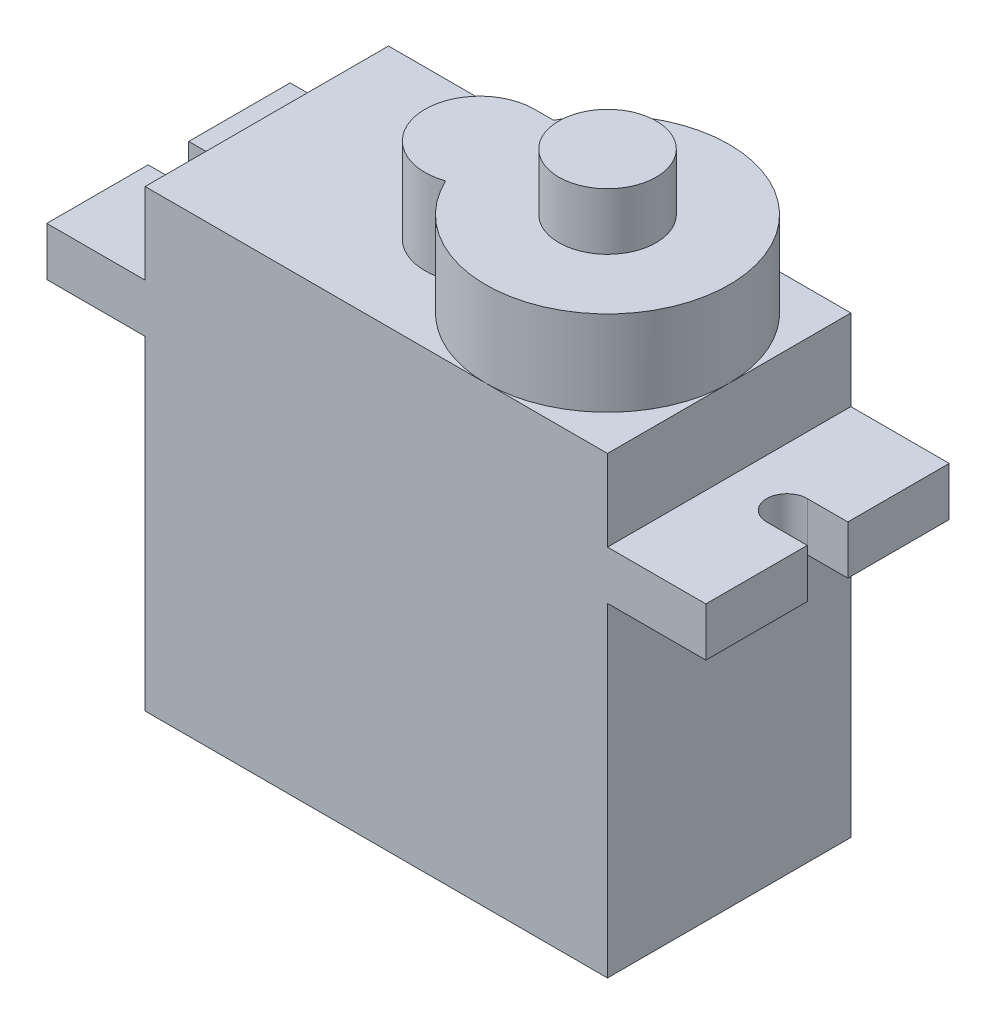
ISO-10303-21;
HEADER;
FILE_DESCRIPTION(('STEP AP214'),'2;1');
FILE_NAME('part.step','',(''),(''),'','','');
FILE_SCHEMA(('AUTOMOTIVE_DESIGN { 1 0 10303 214 1 1 1 1 }'));
ENDSEC;
DATA;
#1=APPLICATION_CONTEXT('core data for automotive mechanical design processes');
#2=APPLICATION_PROTOCOL_DEFINITION('international standard','automotive_design',2000,#1);
#3=PRODUCT_CONTEXT('',#1,'mechanical');
#4=PRODUCT('Part','Part','',(#3));
#5=PRODUCT_RELATED_PRODUCT_CATEGORY('part','',(#4));
#6=PRODUCT_DEFINITION_FORMATION('','',#4);
#7=PRODUCT_DEFINITION_CONTEXT('part definition',#1,'design');
#8=PRODUCT_DEFINITION('design','',#6,#7);
#9=PRODUCT_DEFINITION_SHAPE('','',#8);
#10=(LENGTH_UNIT() NAMED_UNIT(*) SI_UNIT(.MILLI.,.METRE.));
#11=(NAMED_UNIT(*) PLANE_ANGLE_UNIT() SI_UNIT($,.RADIAN.));
#12=(NAMED_UNIT(*) SI_UNIT($,.STERADIAN.) SOLID_ANGLE_UNIT());
#13=UNCERTAINTY_MEASURE_WITH_UNIT(LENGTH_MEASURE(1.E-05),#10,'distance_accuracy_value','');
#14=(GEOMETRIC_REPRESENTATION_CONTEXT(3) GLOBAL_UNCERTAINTY_ASSIGNED_CONTEXT((#13)) GLOBAL_UNIT_ASSIGNED_CONTEXT((#10,
#11,#12)) REPRESENTATION_CONTEXT('',''));
#15=CARTESIAN_POINT('',(0.,0.,0.));
#16=DIRECTION('',(0.,0.,1.));
#17=DIRECTION('',(1.,0.,0.));
#18=AXIS2_PLACEMENT_3D('',#15,#16,#17);
#19=CARTESIAN_POINT('',(0.,10.4,0.));
#20=DIRECTION('',(0.,1.,0.));
#21=DIRECTION('',(0.,0.,1.));
#22=AXIS2_PLACEMENT_3D('',#19,#20,#21);
#23=PLANE('',#22);
#24=CARTESIAN_POINT('',(-14.25,10.4,6.));
#25=DIRECTION('',(0.,1.,0.));
#26=DIRECTION('',(0.,0.,1.));
#27=AXIS2_PLACEMENT_3D('',#24,#25,#26);
#28=CIRCLE('',#27,1.);
#29=CARTESIAN_POINT('',(-14.25,10.4,7.));
#30=VERTEX_POINT('',#29);
#31=CARTESIAN_POINT('',(-14.25,10.4,5.));
#32=VERTEX_POINT('',#31);
#33=EDGE_CURVE('E286',#30,#32,#28,.T.);
#34=ORIENTED_EDGE('',*,*,#33,.F.);
#35=DIRECTION('',(-1.,0.,0.));
#36=VECTOR('',#35,1.);
#37=CARTESIAN_POINT('',(0.,10.4,7.));
#38=LINE('',#37,#36);
#39=CARTESIAN_POINT('',(-16.25,10.4,7.));
#40=VERTEX_POINT('',#39);
#41=EDGE_CURVE('E294',#30,#40,#38,.T.);
#42=ORIENTED_EDGE('',*,*,#41,.T.);
#43=DIRECTION('',(0.,0.,1.));
#44=VECTOR('',#43,1.);
#45=CARTESIAN_POINT('',(-16.25,10.4,0.));
#46=LINE('',#45,#44);
#47=CARTESIAN_POINT('',(-16.25,10.4,12.));
#48=VERTEX_POINT('',#47);
#49=EDGE_CURVE('E435',#40,#48,#46,.T.);
#50=ORIENTED_EDGE('',*,*,#49,.T.);
#51=DIRECTION('',(1.,0.,0.));
#52=VECTOR('',#51,1.);
#53=CARTESIAN_POINT('',(-16.25,10.4,12.));
#54=LINE('',#53,#52);
#55=CARTESIAN_POINT('',(-11.4,10.4,12.));
#56=VERTEX_POINT('',#55);
#57=EDGE_CURVE('E436',#48,#56,#54,.T.);
#58=ORIENTED_EDGE('',*,*,#57,.T.);
#59=DIRECTION('',(0.,0.,1.));
#60=VECTOR('',#59,1.);
#61=CARTESIAN_POINT('',(-11.4,10.4,0.));
#62=LINE('',#61,#60);
#63=CARTESIAN_POINT('',(-11.4,10.4,0.));
#64=VERTEX_POINT('',#63);
#65=EDGE_CURVE('E386',#64,#56,#62,.T.);
#66=ORIENTED_EDGE('',*,*,#65,.F.);
#67=DIRECTION('',(-1.,0.,0.));
#68=VECTOR('',#67,1.);
#69=CARTESIAN_POINT('',(-16.25,10.4,0.));
#70=LINE('',#69,#68);
#71=CARTESIAN_POINT('',(-16.25,10.4,0.));
#72=VERTEX_POINT('',#71);
#73=EDGE_CURVE('E444',#64,#72,#70,.T.);
#74=ORIENTED_EDGE('',*,*,#73,.T.);
#75=CARTESIAN_POINT('',(-16.25,10.4,5.));
#76=VERTEX_POINT('',#75);
#77=EDGE_CURVE('E430',#72,#76,#46,.T.);
#78=ORIENTED_EDGE('',*,*,#77,.T.);
#79=DIRECTION('',(-1.,0.,0.));
#80=VECTOR('',#79,1.);
#81=CARTESIAN_POINT('',(0.,10.4,5.));
#82=LINE('',#81,#80);
#83=EDGE_CURVE('E290',#32,#76,#82,.T.);
#84=ORIENTED_EDGE('',*,*,#83,.F.);
#85=EDGE_LOOP('',(#34,#42,#50,#58,#66,#74,#78,#84));
#86=FACE_BOUND('',#85,.T.);
#87=ADVANCED_FACE('F47',(#86),#23,.T.);
#88=CARTESIAN_POINT('',(-16.25,10.4,0.));
#89=DIRECTION('',(1.,0.,0.));
#90=DIRECTION('',(0.,0.,-1.));
#91=AXIS2_PLACEMENT_3D('',#88,#89,#90);
#92=PLANE('',#91);
#93=DIRECTION('',(0.,1.,0.));
#94=VECTOR('',#93,1.);
#95=CARTESIAN_POINT('',(-16.25,7.6,7.));
#96=LINE('',#95,#94);
#97=CARTESIAN_POINT('',(-16.25,8.,7.));
#98=VERTEX_POINT('',#97);
#99=EDGE_CURVE('E303',#98,#40,#96,.T.);
#100=ORIENTED_EDGE('',*,*,#99,.F.);
#101=DIRECTION('',(0.,0.,1.));
#102=VECTOR('',#101,1.);
#103=CARTESIAN_POINT('',(-16.25,8.,0.));
#104=LINE('',#103,#102);
#105=CARTESIAN_POINT('',(-16.25,8.,12.));
#106=VERTEX_POINT('',#105);
#107=EDGE_CURVE('E429',#98,#106,#104,.T.);
#108=ORIENTED_EDGE('',*,*,#107,.T.);
#109=DIRECTION('',(0.,-1.,0.));
#110=VECTOR('',#109,1.);
#111=CARTESIAN_POINT('',(-16.25,10.4,12.));
#112=LINE('',#111,#110);
#113=EDGE_CURVE('E479',#48,#106,#112,.T.);
#114=ORIENTED_EDGE('',*,*,#113,.F.);
#115=ORIENTED_EDGE('',*,*,#49,.F.);
#116=EDGE_LOOP('',(#100,#108,#114,#115));
#117=FACE_BOUND('',#116,.T.);
#118=ADVANCED_FACE('F610',(#117),#92,.F.);
#119=CARTESIAN_POINT('',(16.25,10.4,0.));
#120=DIRECTION('',(-1.,0.,0.));
#121=DIRECTION('',(0.,0.,1.));
#122=AXIS2_PLACEMENT_3D('',#119,#120,#121);
#123=PLANE('',#122);
#124=DIRECTION('',(0.,1.,0.));
#125=VECTOR('',#124,1.);
#126=CARTESIAN_POINT('',(16.25,7.6,5.));
#127=LINE('',#126,#125);
#128=CARTESIAN_POINT('',(16.25,8.,5.));
#129=VERTEX_POINT('',#128);
#130=CARTESIAN_POINT('',(16.25,10.4,5.));
#131=VERTEX_POINT('',#130);
#132=EDGE_CURVE('E291',#129,#131,#127,.T.);
#133=ORIENTED_EDGE('',*,*,#132,.F.);
#134=DIRECTION('',(0.,0.,-1.));
#135=VECTOR('',#134,1.);
#136=CARTESIAN_POINT('',(16.25,8.,0.));
#137=LINE('',#136,#135);
#138=CARTESIAN_POINT('',(16.25,8.,0.));
#139=VERTEX_POINT('',#138);
#140=EDGE_CURVE('E458',#129,#139,#137,.T.);
#141=ORIENTED_EDGE('',*,*,#140,.T.);
#142=DIRECTION('',(0.,-1.,0.));
#143=VECTOR('',#142,1.);
#144=CARTESIAN_POINT('',(16.25,10.4,0.));
#145=LINE('',#144,#143);
#146=CARTESIAN_POINT('',(16.25,10.4,0.));
#147=VERTEX_POINT('',#146);
#148=EDGE_CURVE('E471',#147,#139,#145,.T.);
#149=ORIENTED_EDGE('',*,*,#148,.F.);
#150=DIRECTION('',(0.,0.,-1.));
#151=VECTOR('',#150,1.);
#152=CARTESIAN_POINT('',(16.25,10.4,0.));
#153=LINE('',#152,#151);
#154=EDGE_CURVE('E439',#131,#147,#153,.T.);
#155=ORIENTED_EDGE('',*,*,#154,.F.);
#156=EDGE_LOOP('',(#133,#141,#149,#155));
#157=FACE_BOUND('',#156,.T.);
#158=ADVANCED_FACE('F647',(#157),#123,.F.);
#159=CARTESIAN_POINT('',(0.,8.,0.));
#160=DIRECTION('',(0.,1.,0.));
#161=DIRECTION('',(0.,0.,1.));
#162=AXIS2_PLACEMENT_3D('',#159,#160,#161);
#163=PLANE('',#162);
#164=DIRECTION('',(-1.,0.,0.));
#165=VECTOR('',#164,1.);
#166=CARTESIAN_POINT('',(0.,8.,7.));
#167=LINE('',#166,#165);
#168=CARTESIAN_POINT('',(-14.25,8.,7.));
#169=VERTEX_POINT('',#168);
#170=EDGE_CURVE('E11',#169,#98,#167,.T.);
#171=ORIENTED_EDGE('',*,*,#170,.F.);
#172=CARTESIAN_POINT('',(-14.25,8.,6.));
#173=DIRECTION('',(0.,1.,0.));
#174=DIRECTION('',(0.,0.,1.));
#175=AXIS2_PLACEMENT_3D('',#172,#173,#174);
#176=CIRCLE('',#175,1.);
#177=CARTESIAN_POINT('',(-14.25,8.,5.));
#178=VERTEX_POINT('',#177);
#179=EDGE_CURVE('E56',#169,#178,#176,.T.);
#180=ORIENTED_EDGE('',*,*,#179,.T.);
#181=DIRECTION('',(-1.,0.,0.));
#182=VECTOR('',#181,1.);
#183=CARTESIAN_POINT('',(0.,8.,5.));
#184=LINE('',#183,#182);
#185=CARTESIAN_POINT('',(-16.25,8.,5.));
#186=VERTEX_POINT('',#185);
#187=EDGE_CURVE('E516',#178,#186,#184,.T.);
#188=ORIENTED_EDGE('',*,*,#187,.T.);
#189=CARTESIAN_POINT('',(-16.25,8.,0.));
#190=VERTEX_POINT('',#189);
#191=EDGE_CURVE('E449',#190,#186,#104,.T.);
#192=ORIENTED_EDGE('',*,*,#191,.F.);
#193=DIRECTION('',(-1.,0.,0.));
#194=VECTOR('',#193,1.);
#195=CARTESIAN_POINT('',(-16.25,8.,0.));
#196=LINE('',#195,#194);
#197=CARTESIAN_POINT('',(-11.4,8.,0.));
#198=VERTEX_POINT('',#197);
#199=EDGE_CURVE('E463',#198,#190,#196,.T.);
#200=ORIENTED_EDGE('',*,*,#199,.F.);
#201=DIRECTION('',(0.,0.,-1.));
#202=VECTOR('',#201,1.);
#203=CARTESIAN_POINT('',(-11.4,8.,12.));
#204=LINE('',#203,#202);
#205=CARTESIAN_POINT('',(-11.4,8.,12.));
#206=VERTEX_POINT('',#205);
#207=EDGE_CURVE('E509',#206,#198,#204,.T.);
#208=ORIENTED_EDGE('',*,*,#207,.F.);
#209=DIRECTION('',(1.,0.,0.));
#210=VECTOR('',#209,1.);
#211=CARTESIAN_POINT('',(-16.25,8.,12.));
#212=LINE('',#211,#210);
#213=EDGE_CURVE('E454',#106,#206,#212,.T.);
#214=ORIENTED_EDGE('',*,*,#213,.F.);
#215=ORIENTED_EDGE('',*,*,#107,.F.);
#216=EDGE_LOOP('',(#171,#180,#188,#192,#200,#208,#214,#215));
#217=FACE_BOUND('',#216,.T.);
#218=ADVANCED_FACE('F523',(#217),#163,.F.);
#219=CARTESIAN_POINT('',(0.,14.4,0.));
#220=DIRECTION('',(0.,1.,0.));
#221=DIRECTION('',(0.,0.,1.));
#222=AXIS2_PLACEMENT_3D('',#219,#220,#221);
#223=PLANE('',#222);
#224=CARTESIAN_POINT('',(-0.9,14.4,6.));
#225=DIRECTION('',(0.,1.,0.));
#226=DIRECTION('',(0.,0.,1.));
#227=AXIS2_PLACEMENT_3D('',#224,#225,#226);
#228=CIRCLE('',#227,2.7);
#229=CARTESIAN_POINT('',(-0.899999999999998,14.4,3.3));
#230=VERTEX_POINT('',#229);
#231=CARTESIAN_POINT('',(-0.0285714285714308,14.4,8.55550625999977));
#232=VERTEX_POINT('',#231);
#233=EDGE_CURVE('E347',#230,#232,#228,.T.);
#234=ORIENTED_EDGE('',*,*,#233,.F.);
#235=DIRECTION('',(1.,0.,0.));
#236=VECTOR('',#235,1.);
#237=CARTESIAN_POINT('',(0.,14.4,3.3));
#238=LINE('',#237,#236);
#239=CARTESIAN_POINT('',(0.041828670152475,14.4,3.3));
#240=VERTEX_POINT('',#239);
#241=EDGE_CURVE('E356',#230,#240,#238,.T.);
#242=ORIENTED_EDGE('',*,*,#241,.T.);
#243=CARTESIAN_POINT('',(5.4,14.4,6.));
#244=DIRECTION('',(0.,1.,0.));
#245=DIRECTION('',(0.,0.,1.));
#246=AXIS2_PLACEMENT_3D('',#243,#244,#245);
#247=CIRCLE('',#246,6.);
#248=CARTESIAN_POINT('',(5.4,14.4,0.));
#249=VERTEX_POINT('',#248);
#250=EDGE_CURVE('E372',#249,#240,#247,.T.);
#251=ORIENTED_EDGE('',*,*,#250,.F.);
#252=DIRECTION('',(-1.,0.,0.));
#253=VECTOR('',#252,1.);
#254=CARTESIAN_POINT('',(-11.4,14.4,0.));
#255=LINE('',#254,#253);
#256=CARTESIAN_POINT('',(-11.4,14.4,0.));
#257=VERTEX_POINT('',#256);
#258=EDGE_CURVE('E402',#249,#257,#255,.T.);
#259=ORIENTED_EDGE('',*,*,#258,.T.);
#260=DIRECTION('',(0.,0.,1.));
#261=VECTOR('',#260,1.);
#262=CARTESIAN_POINT('',(-11.4,14.4,0.));
#263=LINE('',#262,#261);
#264=CARTESIAN_POINT('',(-11.4,14.4,12.));
#265=VERTEX_POINT('',#264);
#266=EDGE_CURVE('E387',#257,#265,#263,.T.);
#267=ORIENTED_EDGE('',*,*,#266,.T.);
#268=DIRECTION('',(1.,0.,0.));
#269=VECTOR('',#268,1.);
#270=CARTESIAN_POINT('',(-11.4,14.4,12.));
#271=LINE('',#270,#269);
#272=CARTESIAN_POINT('',(5.4,14.4,12.));
#273=VERTEX_POINT('',#272);
#274=EDGE_CURVE('E393',#265,#273,#271,.T.);
#275=ORIENTED_EDGE('',*,*,#274,.T.);
#276=EDGE_CURVE('E367',#232,#273,#247,.T.);
#277=ORIENTED_EDGE('',*,*,#276,.F.);
#278=EDGE_LOOP('',(#234,#242,#251,#259,#267,#275,#277));
#279=FACE_BOUND('',#278,.T.);
#280=ADVANCED_FACE('F595',(#279),#223,.T.);
#281=CARTESIAN_POINT('',(11.4,14.4,6.));
#282=VERTEX_POINT('',#281);
#283=EDGE_CURVE('E371',#273,#282,#247,.T.);
#284=ORIENTED_EDGE('',*,*,#283,.F.);
#285=CARTESIAN_POINT('',(11.4,14.4,12.));
#286=VERTEX_POINT('',#285);
#287=EDGE_CURVE('E391',#273,#286,#271,.T.);
#288=ORIENTED_EDGE('',*,*,#287,.T.);
#289=DIRECTION('',(0.,0.,-1.));
#290=VECTOR('',#289,1.);
#291=CARTESIAN_POINT('',(11.4,14.4,0.));
#292=LINE('',#291,#290);
#293=EDGE_CURVE('E398',#286,#282,#292,.T.);
#294=ORIENTED_EDGE('',*,*,#293,.T.);
#295=EDGE_LOOP('',(#284,#288,#294));
#296=FACE_BOUND('',#295,.T.);
#297=ADVANCED_FACE('F560',(#296),#223,.T.);
#298=CARTESIAN_POINT('',(11.4,8.,12.));
#299=DIRECTION('',(-1.,0.,0.));
#300=DIRECTION('',(0.,0.,1.));
#301=AXIS2_PLACEMENT_3D('',#298,#299,#300);
#302=PLANE('',#301);
#303=DIRECTION('',(0.,1.,0.));
#304=VECTOR('',#303,1.);
#305=CARTESIAN_POINT('',(11.4,8.,0.));
#306=LINE('',#305,#304);
#307=CARTESIAN_POINT('',(11.4,-8.,0.));
#308=VERTEX_POINT('',#307);
#309=CARTESIAN_POINT('',(11.4,8.,0.));
#310=VERTEX_POINT('',#309);
#311=EDGE_CURVE('E483',#308,#310,#306,.T.);
#312=ORIENTED_EDGE('',*,*,#311,.T.);
#313=DIRECTION('',(0.,0.,-1.));
#314=VECTOR('',#313,1.);
#315=CARTESIAN_POINT('',(11.4,8.,12.));
#316=LINE('',#315,#314);
#317=CARTESIAN_POINT('',(11.4,8.,12.));
#318=VERTEX_POINT('',#317);
#319=EDGE_CURVE('E512',#318,#310,#316,.T.);
#320=ORIENTED_EDGE('',*,*,#319,.F.);
#321=DIRECTION('',(0.,1.,0.));
#322=VECTOR('',#321,1.);
#323=CARTESIAN_POINT('',(11.4,8.,12.));
#324=LINE('',#323,#322);
#325=CARTESIAN_POINT('',(11.4,-8.,12.));
#326=VERTEX_POINT('',#325);
#327=EDGE_CURVE('E484',#326,#318,#324,.T.);
#328=ORIENTED_EDGE('',*,*,#327,.F.);
#329=DIRECTION('',(0.,0.,-1.));
#330=VECTOR('',#329,1.);
#331=CARTESIAN_POINT('',(11.4,-8.,12.));
#332=LINE('',#331,#330);
#333=EDGE_CURVE('E494',#326,#308,#332,.T.);
#334=ORIENTED_EDGE('',*,*,#333,.T.);
#335=EDGE_LOOP('',(#312,#320,#328,#334));
#336=FACE_BOUND('',#335,.T.);
#337=ADVANCED_FACE('F49',(#336),#302,.F.);
#338=CARTESIAN_POINT('',(-11.4,8.,12.));
#339=DIRECTION('',(1.,0.,0.));
#340=DIRECTION('',(0.,0.,-1.));
#341=AXIS2_PLACEMENT_3D('',#338,#339,#340);
#342=PLANE('',#341);
#343=DIRECTION('',(0.,-1.,0.));
#344=VECTOR('',#343,1.);
#345=CARTESIAN_POINT('',(-11.4,8.,0.));
#346=LINE('',#345,#344);
#347=CARTESIAN_POINT('',(-11.4,-8.,0.));
#348=VERTEX_POINT('',#347);
#349=EDGE_CURVE('E497',#198,#348,#346,.T.);
#350=ORIENTED_EDGE('',*,*,#349,.T.);
#351=DIRECTION('',(0.,0.,-1.));
#352=VECTOR('',#351,1.);
#353=CARTESIAN_POINT('',(-11.4,-8.,12.));
#354=LINE('',#353,#352);
#355=CARTESIAN_POINT('',(-11.4,-8.,12.));
#356=VERTEX_POINT('',#355);
#357=EDGE_CURVE('E505',#356,#348,#354,.T.);
#358=ORIENTED_EDGE('',*,*,#357,.F.);
#359=DIRECTION('',(0.,-1.,0.));
#360=VECTOR('',#359,1.);
#361=CARTESIAN_POINT('',(-11.4,8.,12.));
#362=LINE('',#361,#360);
#363=EDGE_CURVE('E487',#206,#356,#362,.T.);
#364=ORIENTED_EDGE('',*,*,#363,.F.);
#365=ORIENTED_EDGE('',*,*,#207,.T.);
#366=EDGE_LOOP('',(#350,#358,#364,#365));
#367=FACE_BOUND('',#366,.T.);
#368=ADVANCED_FACE('F615',(#367),#342,.F.);
#369=CARTESIAN_POINT('',(-11.4,-8.,12.));
#370=DIRECTION('',(0.,1.,0.));
#371=DIRECTION('',(0.,0.,1.));
#372=AXIS2_PLACEMENT_3D('',#369,#370,#371);
#373=PLANE('',#372);
#374=DIRECTION('',(1.,0.,0.));
#375=VECTOR('',#374,1.);
#376=CARTESIAN_POINT('',(-11.4,-8.,0.));
#377=LINE('',#376,#375);
#378=EDGE_CURVE('E488',#348,#308,#377,.T.);
#379=ORIENTED_EDGE('',*,*,#378,.T.);
#380=ORIENTED_EDGE('',*,*,#333,.F.);
#381=DIRECTION('',(1.,0.,0.));
#382=VECTOR('',#381,1.);
#383=CARTESIAN_POINT('',(-11.4,-8.,12.));
#384=LINE('',#383,#382);
#385=EDGE_CURVE('E491',#356,#326,#384,.T.);
#386=ORIENTED_EDGE('',*,*,#385,.F.);
#387=ORIENTED_EDGE('',*,*,#357,.T.);
#388=EDGE_LOOP('',(#379,#380,#386,#387));
#389=FACE_BOUND('',#388,.T.);
#390=ADVANCED_FACE('F618',(#389),#373,.F.);
#391=CARTESIAN_POINT('',(0.,0.,12.));
#392=DIRECTION('',(0.,0.,1.));
#393=DIRECTION('',(1.,0.,0.));
#394=AXIS2_PLACEMENT_3D('',#391,#392,#393);
#395=PLANE('',#394);
#396=ORIENTED_EDGE('',*,*,#327,.T.);
#397=CARTESIAN_POINT('',(16.25,8.,12.));
#398=VERTEX_POINT('',#397);
#399=EDGE_CURVE('E453',#318,#398,#212,.T.);
#400=ORIENTED_EDGE('',*,*,#399,.T.);
#401=DIRECTION('',(0.,-1.,0.));
#402=VECTOR('',#401,1.);
#403=CARTESIAN_POINT('',(16.25,10.4,12.));
#404=LINE('',#403,#402);
#405=CARTESIAN_POINT('',(16.25,10.4,12.));
#406=VERTEX_POINT('',#405);
#407=EDGE_CURVE('E475',#406,#398,#404,.T.);
#408=ORIENTED_EDGE('',*,*,#407,.F.);
#409=CARTESIAN_POINT('',(11.4,10.4,12.));
#410=VERTEX_POINT('',#409);
#411=EDGE_CURVE('E434',#410,#406,#54,.T.);
#412=ORIENTED_EDGE('',*,*,#411,.F.);
#413=DIRECTION('',(0.,-1.,0.));
#414=VECTOR('',#413,1.);
#415=CARTESIAN_POINT('',(11.4,14.4,12.));
#416=LINE('',#415,#414);
#417=EDGE_CURVE('E421',#286,#410,#416,.T.);
#418=ORIENTED_EDGE('',*,*,#417,.F.);
#419=ORIENTED_EDGE('',*,*,#287,.F.);
#420=ORIENTED_EDGE('',*,*,#274,.F.);
#421=DIRECTION('',(0.,-1.,0.));
#422=VECTOR('',#421,1.);
#423=CARTESIAN_POINT('',(-11.4,14.4,12.));
#424=LINE('',#423,#422);
#425=EDGE_CURVE('E425',#265,#56,#424,.T.);
#426=ORIENTED_EDGE('',*,*,#425,.T.);
#427=ORIENTED_EDGE('',*,*,#57,.F.);
#428=ORIENTED_EDGE('',*,*,#113,.T.);
#429=ORIENTED_EDGE('',*,*,#213,.T.);
#430=ORIENTED_EDGE('',*,*,#363,.T.);
#431=ORIENTED_EDGE('',*,*,#385,.T.);
#432=EDGE_LOOP('',(#396,#400,#408,#412,#418,#419,#420,#426,#427,#428,#429,#430,#431));
#433=FACE_BOUND('',#432,.T.);
#434=ADVANCED_FACE('F565',(#433),#395,.T.);
#435=CARTESIAN_POINT('',(0.,0.,0.));
#436=DIRECTION('',(0.,0.,1.));
#437=DIRECTION('',(1.,0.,0.));
#438=AXIS2_PLACEMENT_3D('',#435,#436,#437);
#439=PLANE('',#438);
#440=DIRECTION('',(1.,0.,0.));
#441=VECTOR('',#440,1.);
#442=CARTESIAN_POINT('',(5.,6.5,0.));
#443=LINE('',#442,#441);
#444=CARTESIAN_POINT('',(-5.,6.5,0.));
#445=VERTEX_POINT('',#444);
#446=CARTESIAN_POINT('',(5.,6.5,0.));
#447=VERTEX_POINT('',#446);
#448=EDGE_CURVE('E272',#445,#447,#443,.T.);
#449=ORIENTED_EDGE('',*,*,#448,.F.);
#450=DIRECTION('',(0.,1.,0.));
#451=VECTOR('',#450,1.);
#452=CARTESIAN_POINT('',(-5.,-6.5,0.));
#453=LINE('',#452,#451);
#454=CARTESIAN_POINT('',(-5.,-6.5,0.));
#455=VERTEX_POINT('',#454);
#456=EDGE_CURVE('E63',#455,#445,#453,.T.);
#457=ORIENTED_EDGE('',*,*,#456,.F.);
#458=DIRECTION('',(-1.,0.,0.));
#459=VECTOR('',#458,1.);
#460=CARTESIAN_POINT('',(5.,-6.5,0.));
#461=LINE('',#460,#459);
#462=CARTESIAN_POINT('',(5.,-6.5,0.));
#463=VERTEX_POINT('',#462);
#464=EDGE_CURVE('E259',#463,#455,#461,.T.);
#465=ORIENTED_EDGE('',*,*,#464,.F.);
#466=DIRECTION('',(0.,-1.,0.));
#467=VECTOR('',#466,1.);
#468=CARTESIAN_POINT('',(5.,-6.5,0.));
#469=LINE('',#468,#467);
#470=EDGE_CURVE('E263',#447,#463,#469,.T.);
#471=ORIENTED_EDGE('',*,*,#470,.F.);
#472=EDGE_LOOP('',(#449,#457,#465,#471));
#473=FACE_BOUND('',#472,.T.);
#474=ORIENTED_EDGE('',*,*,#311,.F.);
#475=ORIENTED_EDGE('',*,*,#378,.F.);
#476=ORIENTED_EDGE('',*,*,#349,.F.);
#477=ORIENTED_EDGE('',*,*,#199,.T.);
#478=DIRECTION('',(0.,-1.,0.));
#479=VECTOR('',#478,1.);
#480=CARTESIAN_POINT('',(-16.25,10.4,0.));
#481=LINE('',#480,#479);
#482=EDGE_CURVE('E448',#72,#190,#481,.T.);
#483=ORIENTED_EDGE('',*,*,#482,.F.);
#484=ORIENTED_EDGE('',*,*,#73,.F.);
#485=DIRECTION('',(0.,-1.,0.));
#486=VECTOR('',#485,1.);
#487=CARTESIAN_POINT('',(-11.4,14.4,0.));
#488=LINE('',#487,#486);
#489=EDGE_CURVE('E407',#257,#64,#488,.T.);
#490=ORIENTED_EDGE('',*,*,#489,.F.);
#491=ORIENTED_EDGE('',*,*,#258,.F.);
#492=CARTESIAN_POINT('',(11.4,14.4,0.));
#493=VERTEX_POINT('',#492);
#494=EDGE_CURVE('E403',#493,#249,#255,.T.);
#495=ORIENTED_EDGE('',*,*,#494,.F.);
#496=DIRECTION('',(0.,-1.,0.));
#497=VECTOR('',#496,1.);
#498=CARTESIAN_POINT('',(11.4,14.4,0.));
#499=LINE('',#498,#497);
#500=CARTESIAN_POINT('',(11.4,10.4,0.));
#501=VERTEX_POINT('',#500);
#502=EDGE_CURVE('E417',#493,#501,#499,.T.);
#503=ORIENTED_EDGE('',*,*,#502,.T.);
#504=EDGE_CURVE('E445',#147,#501,#70,.T.);
#505=ORIENTED_EDGE('',*,*,#504,.F.);
#506=ORIENTED_EDGE('',*,*,#148,.T.);
#507=EDGE_CURVE('E464',#139,#310,#196,.T.);
#508=ORIENTED_EDGE('',*,*,#507,.T.);
#509=EDGE_LOOP('',(#474,#475,#476,#477,#483,#484,#490,#491,#495,#503,#505,#506,#508));
#510=FACE_BOUND('',#509,.T.);
#511=ADVANCED_FACE('F605',(#473,#510),#439,.F.);
#512=DIRECTION('',(1.,0.,0.));
#513=VECTOR('',#512,1.);
#514=CARTESIAN_POINT('',(0.,8.,5.));
#515=LINE('',#514,#513);
#516=CARTESIAN_POINT('',(14.25,8.,5.));
#517=VERTEX_POINT('',#516);
#518=EDGE_CURVE('E339',#517,#129,#515,.T.);
#519=ORIENTED_EDGE('',*,*,#518,.F.);
#520=CARTESIAN_POINT('',(14.25,8.,6.));
#521=DIRECTION('',(0.,1.,0.));
#522=DIRECTION('',(0.,0.,1.));
#523=AXIS2_PLACEMENT_3D('',#520,#521,#522);
#524=CIRCLE('',#523,1.);
#525=CARTESIAN_POINT('',(14.25,8.,7.));
#526=VERTEX_POINT('',#525);
#527=EDGE_CURVE('E302',#526,#517,#524,.F.);
#528=ORIENTED_EDGE('',*,*,#527,.F.);
#529=DIRECTION('',(1.,0.,0.));
#530=VECTOR('',#529,1.);
#531=CARTESIAN_POINT('',(0.,8.,7.));
#532=LINE('',#531,#530);
#533=CARTESIAN_POINT('',(16.25,8.,7.));
#534=VERTEX_POINT('',#533);
#535=EDGE_CURVE('E335',#526,#534,#532,.T.);
#536=ORIENTED_EDGE('',*,*,#535,.T.);
#537=EDGE_CURVE('E459',#398,#534,#137,.T.);
#538=ORIENTED_EDGE('',*,*,#537,.F.);
#539=ORIENTED_EDGE('',*,*,#399,.F.);
#540=ORIENTED_EDGE('',*,*,#319,.T.);
#541=ORIENTED_EDGE('',*,*,#507,.F.);
#542=ORIENTED_EDGE('',*,*,#140,.F.);
#543=EDGE_LOOP('',(#519,#528,#536,#538,#539,#540,#541,#542));
#544=FACE_BOUND('',#543,.T.);
#545=ADVANCED_FACE('F629',(#544),#163,.F.);
#546=ORIENTED_EDGE('',*,*,#191,.T.);
#547=DIRECTION('',(0.,1.,0.));
#548=VECTOR('',#547,1.);
#549=CARTESIAN_POINT('',(-16.25,7.6,5.));
#550=LINE('',#549,#548);
#551=EDGE_CURVE('E306',#186,#76,#550,.T.);
#552=ORIENTED_EDGE('',*,*,#551,.T.);
#553=ORIENTED_EDGE('',*,*,#77,.F.);
#554=ORIENTED_EDGE('',*,*,#482,.T.);
#555=EDGE_LOOP('',(#546,#552,#553,#554));
#556=FACE_BOUND('',#555,.T.);
#557=ADVANCED_FACE('F542',(#556),#92,.F.);
#558=ORIENTED_EDGE('',*,*,#537,.T.);
#559=DIRECTION('',(0.,1.,0.));
#560=VECTOR('',#559,1.);
#561=CARTESIAN_POINT('',(16.25,7.6,7.));
#562=LINE('',#561,#560);
#563=CARTESIAN_POINT('',(16.25,10.4,7.));
#564=VERTEX_POINT('',#563);
#565=EDGE_CURVE('E324',#534,#564,#562,.T.);
#566=ORIENTED_EDGE('',*,*,#565,.T.);
#567=EDGE_CURVE('E440',#406,#564,#153,.T.);
#568=ORIENTED_EDGE('',*,*,#567,.F.);
#569=ORIENTED_EDGE('',*,*,#407,.T.);
#570=EDGE_LOOP('',(#558,#566,#568,#569));
#571=FACE_BOUND('',#570,.T.);
#572=ADVANCED_FACE('F627',(#571),#123,.F.);
#573=CARTESIAN_POINT('',(14.25,10.4,6.));
#574=DIRECTION('',(0.,1.,0.));
#575=DIRECTION('',(0.,0.,1.));
#576=AXIS2_PLACEMENT_3D('',#573,#574,#575);
#577=CIRCLE('',#576,1.);
#578=CARTESIAN_POINT('',(14.25,10.4,7.));
#579=VERTEX_POINT('',#578);
#580=CARTESIAN_POINT('',(14.25,10.4,5.));
#581=VERTEX_POINT('',#580);
#582=EDGE_CURVE('E314',#579,#581,#577,.F.);
#583=ORIENTED_EDGE('',*,*,#582,.T.);
#584=DIRECTION('',(1.,0.,0.));
#585=VECTOR('',#584,1.);
#586=CARTESIAN_POINT('',(0.,10.4,5.));
#587=LINE('',#586,#585);
#588=EDGE_CURVE('E71',#581,#131,#587,.T.);
#589=ORIENTED_EDGE('',*,*,#588,.T.);
#590=ORIENTED_EDGE('',*,*,#154,.T.);
#591=ORIENTED_EDGE('',*,*,#504,.T.);
#592=DIRECTION('',(0.,0.,-1.));
#593=VECTOR('',#592,1.);
#594=CARTESIAN_POINT('',(11.4,10.4,0.));
#595=LINE('',#594,#593);
#596=EDGE_CURVE('E392',#410,#501,#595,.T.);
#597=ORIENTED_EDGE('',*,*,#596,.F.);
#598=ORIENTED_EDGE('',*,*,#411,.T.);
#599=ORIENTED_EDGE('',*,*,#567,.T.);
#600=DIRECTION('',(1.,0.,0.));
#601=VECTOR('',#600,1.);
#602=CARTESIAN_POINT('',(0.,10.4,7.));
#603=LINE('',#602,#601);
#604=EDGE_CURVE('E318',#579,#564,#603,.T.);
#605=ORIENTED_EDGE('',*,*,#604,.F.);
#606=EDGE_LOOP('',(#583,#589,#590,#591,#597,#598,#599,#605));
#607=FACE_BOUND('',#606,.T.);
#608=ADVANCED_FACE('F639',(#607),#23,.T.);
#609=CARTESIAN_POINT('',(-11.4,14.4,0.));
#610=DIRECTION('',(1.,0.,0.));
#611=DIRECTION('',(0.,0.,-1.));
#612=AXIS2_PLACEMENT_3D('',#609,#610,#611);
#613=PLANE('',#612);
#614=ORIENTED_EDGE('',*,*,#65,.T.);
#615=ORIENTED_EDGE('',*,*,#425,.F.);
#616=ORIENTED_EDGE('',*,*,#266,.F.);
#617=ORIENTED_EDGE('',*,*,#489,.T.);
#618=EDGE_LOOP('',(#614,#615,#616,#617));
#619=FACE_BOUND('',#618,.T.);
#620=ADVANCED_FACE('F601',(#619),#613,.F.);
#621=CARTESIAN_POINT('',(11.4,14.4,0.));
#622=DIRECTION('',(-1.,0.,0.));
#623=DIRECTION('',(0.,0.,1.));
#624=AXIS2_PLACEMENT_3D('',#621,#622,#623);
#625=PLANE('',#624);
#626=ORIENTED_EDGE('',*,*,#596,.T.);
#627=ORIENTED_EDGE('',*,*,#502,.F.);
#628=EDGE_CURVE('E397',#282,#493,#292,.T.);
#629=ORIENTED_EDGE('',*,*,#628,.F.);
#630=ORIENTED_EDGE('',*,*,#293,.F.);
#631=ORIENTED_EDGE('',*,*,#417,.T.);
#632=EDGE_LOOP('',(#626,#627,#629,#630,#631));
#633=FACE_BOUND('',#632,.T.);
#634=ADVANCED_FACE('F569',(#633),#625,.F.);
#635=EDGE_CURVE('E575',#282,#249,#247,.T.);
#636=ORIENTED_EDGE('',*,*,#635,.F.);
#637=ORIENTED_EDGE('',*,*,#628,.T.);
#638=ORIENTED_EDGE('',*,*,#494,.T.);
#639=EDGE_LOOP('',(#636,#637,#638));
#640=FACE_BOUND('',#639,.T.);
#641=ADVANCED_FACE('F573',(#640),#223,.T.);
#642=CARTESIAN_POINT('',(-0.9,18.6,6.));
#643=DIRECTION('',(0.,-1.,0.));
#644=DIRECTION('',(0.,0.,-1.));
#645=AXIS2_PLACEMENT_3D('',#642,#643,#644);
#646=CYLINDRICAL_SURFACE('',#645,2.7);
#647=ORIENTED_EDGE('',*,*,#233,.T.);
#648=DIRECTION('',(0.,-1.,0.));
#649=VECTOR('',#648,1.);
#650=CARTESIAN_POINT('',(-0.0285714285714308,18.6,8.55550625999977));
#651=LINE('',#650,#649);
#652=CARTESIAN_POINT('',(-0.0285714285714308,18.6,8.55550625999977));
#653=VERTEX_POINT('',#652);
#654=EDGE_CURVE('E382',#653,#232,#651,.T.);
#655=ORIENTED_EDGE('',*,*,#654,.F.);
#656=CARTESIAN_POINT('',(-0.9,18.6,6.));
#657=DIRECTION('',(0.,1.,0.));
#658=DIRECTION('',(0.,0.,1.));
#659=AXIS2_PLACEMENT_3D('',#656,#657,#658);
#660=CIRCLE('',#659,2.7);
#661=CARTESIAN_POINT('',(-0.899999999999998,18.6,3.3));
#662=VERTEX_POINT('',#661);
#663=EDGE_CURVE('E351',#662,#653,#660,.T.);
#664=ORIENTED_EDGE('',*,*,#663,.F.);
#665=DIRECTION('',(0.,-1.,0.));
#666=VECTOR('',#665,1.);
#667=CARTESIAN_POINT('',(-0.899999999999998,18.6,3.3));
#668=LINE('',#667,#666);
#669=EDGE_CURVE('E363',#662,#230,#668,.T.);
#670=ORIENTED_EDGE('',*,*,#669,.T.);
#671=EDGE_LOOP('',(#647,#655,#664,#670));
#672=FACE_BOUND('',#671,.T.);
#673=ADVANCED_FACE('F594',(#672),#646,.T.);
#674=CARTESIAN_POINT('',(5.4,18.6,6.));
#675=DIRECTION('',(0.,-1.,0.));
#676=DIRECTION('',(0.,0.,-1.));
#677=AXIS2_PLACEMENT_3D('',#674,#675,#676);
#678=CYLINDRICAL_SURFACE('',#677,6.);
#679=ORIENTED_EDGE('',*,*,#276,.T.);
#680=ORIENTED_EDGE('',*,*,#283,.T.);
#681=ORIENTED_EDGE('',*,*,#635,.T.);
#682=ORIENTED_EDGE('',*,*,#250,.T.);
#683=DIRECTION('',(0.,-1.,0.));
#684=VECTOR('',#683,1.);
#685=CARTESIAN_POINT('',(0.041828670152475,18.6,3.3));
#686=LINE('',#685,#684);
#687=CARTESIAN_POINT('',(0.041828670152475,18.6,3.3));
#688=VERTEX_POINT('',#687);
#689=EDGE_CURVE('E378',#688,#240,#686,.T.);
#690=ORIENTED_EDGE('',*,*,#689,.F.);
#691=CARTESIAN_POINT('',(5.4,18.6,6.));
#692=DIRECTION('',(0.,1.,0.));
#693=DIRECTION('',(0.,0.,1.));
#694=AXIS2_PLACEMENT_3D('',#691,#692,#693);
#695=CIRCLE('',#694,6.);
#696=EDGE_CURVE('E355',#653,#688,#695,.T.);
#697=ORIENTED_EDGE('',*,*,#696,.F.);
#698=ORIENTED_EDGE('',*,*,#654,.T.);
#699=EDGE_LOOP('',(#679,#680,#681,#682,#690,#697,#698));
#700=FACE_BOUND('',#699,.T.);
#701=ADVANCED_FACE('F582',(#700),#678,.T.);
#702=CARTESIAN_POINT('',(0.,18.6,3.3));
#703=DIRECTION('',(0.,0.,-1.));
#704=DIRECTION('',(-1.,0.,0.));
#705=AXIS2_PLACEMENT_3D('',#702,#703,#704);
#706=PLANE('',#705);
#707=ORIENTED_EDGE('',*,*,#241,.F.);
#708=ORIENTED_EDGE('',*,*,#669,.F.);
#709=DIRECTION('',(1.,0.,0.));
#710=VECTOR('',#709,1.);
#711=CARTESIAN_POINT('',(0.,18.6,3.3));
#712=LINE('',#711,#710);
#713=EDGE_CURVE('E359',#662,#688,#712,.T.);
#714=ORIENTED_EDGE('',*,*,#713,.T.);
#715=ORIENTED_EDGE('',*,*,#689,.T.);
#716=EDGE_LOOP('',(#707,#708,#714,#715));
#717=FACE_BOUND('',#716,.T.);
#718=ADVANCED_FACE('F587',(#717),#706,.T.);
#719=CARTESIAN_POINT('',(0.,18.6,0.));
#720=DIRECTION('',(0.,1.,0.));
#721=DIRECTION('',(0.,0.,1.));
#722=AXIS2_PLACEMENT_3D('',#719,#720,#721);
#723=PLANE('',#722);
#724=CARTESIAN_POINT('',(5.4,18.6,6.));
#725=DIRECTION('',(0.,1.,0.));
#726=DIRECTION('',(0.,0.,1.));
#727=AXIS2_PLACEMENT_3D('',#724,#725,#726);
#728=CIRCLE('',#727,2.4);
#729=CARTESIAN_POINT('',(5.4,18.6,8.4));
#730=VERTEX_POINT('',#729);
#731=EDGE_CURVE('E342',#730,#730,#728,.T.);
#732=ORIENTED_EDGE('',*,*,#731,.F.);
#733=EDGE_LOOP('',(#732));
#734=FACE_BOUND('',#733,.T.);
#735=ORIENTED_EDGE('',*,*,#663,.T.);
#736=ORIENTED_EDGE('',*,*,#696,.T.);
#737=ORIENTED_EDGE('',*,*,#713,.F.);
#738=EDGE_LOOP('',(#735,#736,#737));
#739=FACE_BOUND('',#738,.T.);
#740=ADVANCED_FACE('F591',(#734,#739),#723,.T.);
#741=CARTESIAN_POINT('',(5.4,21.4,6.));
#742=DIRECTION('',(0.,-1.,0.));
#743=DIRECTION('',(0.,0.,-1.));
#744=AXIS2_PLACEMENT_3D('',#741,#742,#743);
#745=CYLINDRICAL_SURFACE('',#744,2.4);
#746=CARTESIAN_POINT('',(5.4,21.4,6.));
#747=DIRECTION('',(0.,1.,0.));
#748=DIRECTION('',(0.,0.,1.));
#749=AXIS2_PLACEMENT_3D('',#746,#747,#748);
#750=CIRCLE('',#749,2.4);
#751=CARTESIAN_POINT('',(5.4,21.4,8.4));
#752=VERTEX_POINT('',#751);
#753=EDGE_CURVE('E343',#752,#752,#750,.T.);
#754=ORIENTED_EDGE('',*,*,#753,.F.);
#755=EDGE_LOOP('',(#754));
#756=FACE_BOUND('',#755,.T.);
#757=ORIENTED_EDGE('',*,*,#731,.T.);
#758=EDGE_LOOP('',(#757));
#759=FACE_BOUND('',#758,.T.);
#760=ADVANCED_FACE('F781',(#756,#759),#745,.T.);
#761=CARTESIAN_POINT('',(5.4,21.4,6.));
#762=DIRECTION('',(0.,1.,0.));
#763=DIRECTION('',(0.,0.,1.));
#764=AXIS2_PLACEMENT_3D('',#761,#762,#763);
#765=PLANE('',#764);
#766=ORIENTED_EDGE('',*,*,#753,.T.);
#767=EDGE_LOOP('',(#766));
#768=FACE_BOUND('',#767,.T.);
#769=ADVANCED_FACE('F797',(#768),#765,.T.);
#770=CARTESIAN_POINT('',(-14.25,7.6,6.));
#771=DIRECTION('',(0.,1.,0.));
#772=DIRECTION('',(0.,0.,1.));
#773=AXIS2_PLACEMENT_3D('',#770,#771,#772);
#774=CYLINDRICAL_SURFACE('',#773,1.);
#775=DIRECTION('',(0.,1.,0.));
#776=VECTOR('',#775,1.);
#777=CARTESIAN_POINT('',(-14.25,7.6,7.));
#778=LINE('',#777,#776);
#779=EDGE_CURVE('E299',#169,#30,#778,.T.);
#780=ORIENTED_EDGE('',*,*,#779,.T.);
#781=ORIENTED_EDGE('',*,*,#33,.T.);
#782=DIRECTION('',(0.,1.,0.));
#783=VECTOR('',#782,1.);
#784=CARTESIAN_POINT('',(-14.25,7.6,5.));
#785=LINE('',#784,#783);
#786=EDGE_CURVE('E298',#178,#32,#785,.T.);
#787=ORIENTED_EDGE('',*,*,#786,.F.);
#788=ORIENTED_EDGE('',*,*,#179,.F.);
#789=EDGE_LOOP('',(#780,#781,#787,#788));
#790=FACE_BOUND('',#789,.T.);
#791=ADVANCED_FACE('F529',(#790),#774,.F.);
#792=CARTESIAN_POINT('',(0.,7.6,7.));
#793=DIRECTION('',(0.,0.,-1.));
#794=DIRECTION('',(-1.,0.,0.));
#795=AXIS2_PLACEMENT_3D('',#792,#793,#794);
#796=PLANE('',#795);
#797=ORIENTED_EDGE('',*,*,#170,.T.);
#798=ORIENTED_EDGE('',*,*,#99,.T.);
#799=ORIENTED_EDGE('',*,*,#41,.F.);
#800=ORIENTED_EDGE('',*,*,#779,.F.);
#801=EDGE_LOOP('',(#797,#798,#799,#800));
#802=FACE_BOUND('',#801,.T.);
#803=ADVANCED_FACE('F532',(#802),#796,.T.);
#804=CARTESIAN_POINT('',(0.,7.6,5.));
#805=DIRECTION('',(0.,0.,-1.));
#806=DIRECTION('',(-1.,0.,0.));
#807=AXIS2_PLACEMENT_3D('',#804,#805,#806);
#808=PLANE('',#807);
#809=ORIENTED_EDGE('',*,*,#786,.T.);
#810=ORIENTED_EDGE('',*,*,#83,.T.);
#811=ORIENTED_EDGE('',*,*,#551,.F.);
#812=ORIENTED_EDGE('',*,*,#187,.F.);
#813=EDGE_LOOP('',(#809,#810,#811,#812));
#814=FACE_BOUND('',#813,.T.);
#815=ADVANCED_FACE('F540',(#814),#808,.F.);
#816=CARTESIAN_POINT('',(0.,7.6,5.));
#817=DIRECTION('',(0.,0.,1.));
#818=DIRECTION('',(1.,0.,0.));
#819=AXIS2_PLACEMENT_3D('',#816,#817,#818);
#820=PLANE('',#819);
#821=ORIENTED_EDGE('',*,*,#518,.T.);
#822=ORIENTED_EDGE('',*,*,#132,.T.);
#823=ORIENTED_EDGE('',*,*,#588,.F.);
#824=DIRECTION('',(0.,1.,0.));
#825=VECTOR('',#824,1.);
#826=CARTESIAN_POINT('',(14.25,7.6,5.));
#827=LINE('',#826,#825);
#828=EDGE_CURVE('E321',#517,#581,#827,.T.);
#829=ORIENTED_EDGE('',*,*,#828,.F.);
#830=EDGE_LOOP('',(#821,#822,#823,#829));
#831=FACE_BOUND('',#830,.T.);
#832=ADVANCED_FACE('F648',(#831),#820,.T.);
#833=CARTESIAN_POINT('',(0.,7.6,7.));
#834=DIRECTION('',(0.,0.,1.));
#835=DIRECTION('',(1.,0.,0.));
#836=AXIS2_PLACEMENT_3D('',#833,#834,#835);
#837=PLANE('',#836);
#838=DIRECTION('',(0.,1.,0.));
#839=VECTOR('',#838,1.);
#840=CARTESIAN_POINT('',(14.25,7.6,7.));
#841=LINE('',#840,#839);
#842=EDGE_CURVE('E328',#526,#579,#841,.T.);
#843=ORIENTED_EDGE('',*,*,#842,.T.);
#844=ORIENTED_EDGE('',*,*,#604,.T.);
#845=ORIENTED_EDGE('',*,*,#565,.F.);
#846=ORIENTED_EDGE('',*,*,#535,.F.);
#847=EDGE_LOOP('',(#843,#844,#845,#846));
#848=FACE_BOUND('',#847,.T.);
#849=ADVANCED_FACE('F633',(#848),#837,.F.);
#850=CARTESIAN_POINT('',(14.25,7.6,6.));
#851=DIRECTION('',(0.,1.,0.));
#852=DIRECTION('',(0.,0.,1.));
#853=AXIS2_PLACEMENT_3D('',#850,#851,#852);
#854=CYLINDRICAL_SURFACE('',#853,1.);
#855=ORIENTED_EDGE('',*,*,#527,.T.);
#856=ORIENTED_EDGE('',*,*,#828,.T.);
#857=ORIENTED_EDGE('',*,*,#582,.F.);
#858=ORIENTED_EDGE('',*,*,#842,.F.);
#859=EDGE_LOOP('',(#855,#856,#857,#858));
#860=FACE_BOUND('',#859,.T.);
#861=ADVANCED_FACE('F636',(#860),#854,.F.);
#862=CARTESIAN_POINT('',(-5.,-6.5,1.));
#863=DIRECTION('',(-1.,0.,0.));
#864=DIRECTION('',(0.,0.,1.));
#865=AXIS2_PLACEMENT_3D('',#862,#863,#864);
#866=PLANE('',#865);
#867=ORIENTED_EDGE('',*,*,#456,.T.);
#868=DIRECTION('',(0.,0.,-1.));
#869=VECTOR('',#868,1.);
#870=CARTESIAN_POINT('',(-5.,6.5,1.));
#871=LINE('',#870,#869);
#872=CARTESIAN_POINT('',(-5.,6.5,1.));
#873=VERTEX_POINT('',#872);
#874=EDGE_CURVE('E234',#873,#445,#871,.T.);
#875=ORIENTED_EDGE('',*,*,#874,.F.);
#876=DIRECTION('',(0.,1.,0.));
#877=VECTOR('',#876,1.);
#878=CARTESIAN_POINT('',(-5.,-6.5,1.));
#879=LINE('',#878,#877);
#880=CARTESIAN_POINT('',(-5.,-6.5,1.));
#881=VERTEX_POINT('',#880);
#882=EDGE_CURVE('E238',#881,#873,#879,.T.);
#883=ORIENTED_EDGE('',*,*,#882,.F.);
#884=DIRECTION('',(0.,0.,-1.));
#885=VECTOR('',#884,1.);
#886=CARTESIAN_POINT('',(-5.,-6.5,1.));
#887=LINE('',#886,#885);
#888=EDGE_CURVE('E278',#881,#455,#887,.T.);
#889=ORIENTED_EDGE('',*,*,#888,.T.);
#890=EDGE_LOOP('',(#867,#875,#883,#889));
#891=FACE_BOUND('',#890,.T.);
#892=ADVANCED_FACE('F236',(#891),#866,.F.);
#893=CARTESIAN_POINT('',(5.,-6.5,1.));
#894=DIRECTION('',(0.,-1.,0.));
#895=DIRECTION('',(0.,0.,-1.));
#896=AXIS2_PLACEMENT_3D('',#893,#894,#895);
#897=PLANE('',#896);
#898=ORIENTED_EDGE('',*,*,#464,.T.);
#899=ORIENTED_EDGE('',*,*,#888,.F.);
#900=DIRECTION('',(-1.,0.,0.));
#901=VECTOR('',#900,1.);
#902=CARTESIAN_POINT('',(5.,-6.5,1.));
#903=LINE('',#902,#901);
#904=CARTESIAN_POINT('',(5.,-6.5,1.));
#905=VERTEX_POINT('',#904);
#906=EDGE_CURVE('E245',#905,#881,#903,.T.);
#907=ORIENTED_EDGE('',*,*,#906,.F.);
#908=DIRECTION('',(0.,0.,-1.));
#909=VECTOR('',#908,1.);
#910=CARTESIAN_POINT('',(5.,-6.5,1.));
#911=LINE('',#910,#909);
#912=EDGE_CURVE('E281',#905,#463,#911,.T.);
#913=ORIENTED_EDGE('',*,*,#912,.T.);
#914=EDGE_LOOP('',(#898,#899,#907,#913));
#915=FACE_BOUND('',#914,.T.);
#916=ADVANCED_FACE('F871',(#915),#897,.F.);
#917=CARTESIAN_POINT('',(5.,-6.5,1.));
#918=DIRECTION('',(1.,0.,0.));
#919=DIRECTION('',(0.,0.,-1.));
#920=AXIS2_PLACEMENT_3D('',#917,#918,#919);
#921=PLANE('',#920);
#922=ORIENTED_EDGE('',*,*,#470,.T.);
#923=ORIENTED_EDGE('',*,*,#912,.F.);
#924=DIRECTION('',(0.,-1.,0.));
#925=VECTOR('',#924,1.);
#926=CARTESIAN_POINT('',(5.,-6.5,1.));
#927=LINE('',#926,#925);
#928=CARTESIAN_POINT('',(5.,6.5,1.));
#929=VERTEX_POINT('',#928);
#930=EDGE_CURVE('E254',#929,#905,#927,.T.);
#931=ORIENTED_EDGE('',*,*,#930,.F.);
#932=DIRECTION('',(0.,0.,-1.));
#933=VECTOR('',#932,1.);
#934=CARTESIAN_POINT('',(5.,6.5,1.));
#935=LINE('',#934,#933);
#936=EDGE_CURVE('E244',#929,#447,#935,.T.);
#937=ORIENTED_EDGE('',*,*,#936,.T.);
#938=EDGE_LOOP('',(#922,#923,#931,#937));
#939=FACE_BOUND('',#938,.T.);
#940=ADVANCED_FACE('F880',(#939),#921,.F.);
#941=CARTESIAN_POINT('',(5.,6.5,1.));
#942=DIRECTION('',(0.,1.,0.));
#943=DIRECTION('',(0.,0.,1.));
#944=AXIS2_PLACEMENT_3D('',#941,#942,#943);
#945=PLANE('',#944);
#946=ORIENTED_EDGE('',*,*,#448,.T.);
#947=ORIENTED_EDGE('',*,*,#936,.F.);
#948=DIRECTION('',(1.,0.,0.));
#949=VECTOR('',#948,1.);
#950=CARTESIAN_POINT('',(5.,6.5,1.));
#951=LINE('',#950,#949);
#952=EDGE_CURVE('E248',#873,#929,#951,.T.);
#953=ORIENTED_EDGE('',*,*,#952,.F.);
#954=ORIENTED_EDGE('',*,*,#874,.T.);
#955=EDGE_LOOP('',(#946,#947,#953,#954));
#956=FACE_BOUND('',#955,.T.);
#957=ADVANCED_FACE('F249',(#956),#945,.F.);
#958=CARTESIAN_POINT('',(0.,0.,1.));
#959=DIRECTION('',(0.,0.,1.));
#960=DIRECTION('',(1.,0.,0.));
#961=AXIS2_PLACEMENT_3D('',#958,#959,#960);
#962=PLANE('',#961);
#963=ORIENTED_EDGE('',*,*,#882,.T.);
#964=ORIENTED_EDGE('',*,*,#952,.T.);
#965=ORIENTED_EDGE('',*,*,#930,.T.);
#966=ORIENTED_EDGE('',*,*,#906,.T.);
#967=EDGE_LOOP('',(#963,#964,#965,#966));
#968=FACE_BOUND('',#967,.T.);
#969=ADVANCED_FACE('F256',(#968),#962,.F.);
#970=CLOSED_SHELL('',(#87,#118,#158,#218,#280,#297,#337,#368,#390,#434,#511,#545,#557,#572,#608,
#620,#634,#641,#673,#701,#718,#740,#760,#769,#791,#803,#815,#832,#849,#861,#892,#916,#940,#957,#969));
#971=MANIFOLD_SOLID_BREP('B2',#970);
#972=ADVANCED_BREP_SHAPE_REPRESENTATION('',(#18,#971),#14);
#973=SHAPE_DEFINITION_REPRESENTATION(#9,#972);
ENDSEC;
END-ISO-10303-21;
